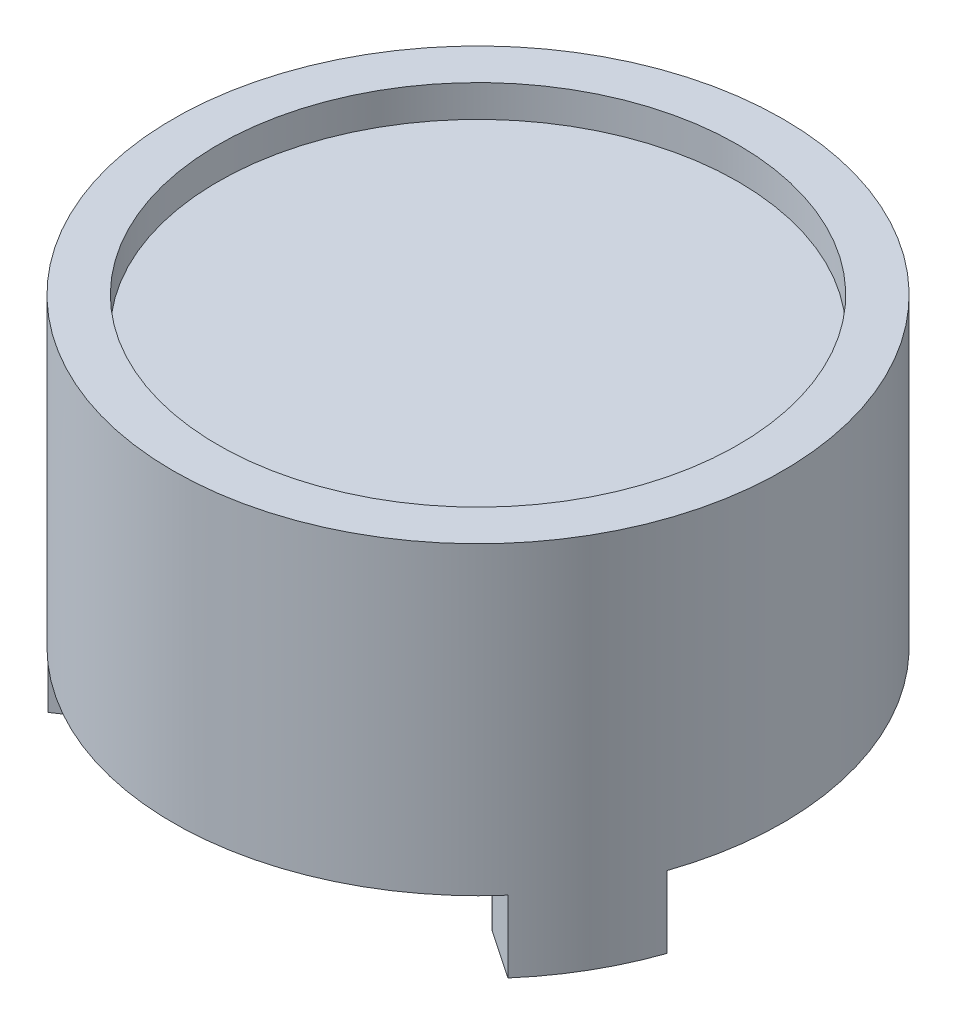
ISO-10303-21;
HEADER;
FILE_DESCRIPTION(('STEP AP214'),'2;1');
FILE_NAME('part.step','',(''),(''),'','','');
FILE_SCHEMA(('AUTOMOTIVE_DESIGN { 1 0 10303 214 1 1 1 1 }'));
ENDSEC;
DATA;
#1=APPLICATION_CONTEXT('core data for automotive mechanical design processes');
#2=APPLICATION_PROTOCOL_DEFINITION('international standard','automotive_design',2000,#1);
#3=PRODUCT_CONTEXT('',#1,'mechanical');
#4=PRODUCT('Part','Part','',(#3));
#5=PRODUCT_RELATED_PRODUCT_CATEGORY('part','',(#4));
#6=PRODUCT_DEFINITION_FORMATION('','',#4);
#7=PRODUCT_DEFINITION_CONTEXT('part definition',#1,'design');
#8=PRODUCT_DEFINITION('design','',#6,#7);
#9=PRODUCT_DEFINITION_SHAPE('','',#8);
#10=(LENGTH_UNIT() NAMED_UNIT(*) SI_UNIT(.MILLI.,.METRE.));
#11=(NAMED_UNIT(*) PLANE_ANGLE_UNIT() SI_UNIT($,.RADIAN.));
#12=(NAMED_UNIT(*) SI_UNIT($,.STERADIAN.) SOLID_ANGLE_UNIT());
#13=UNCERTAINTY_MEASURE_WITH_UNIT(LENGTH_MEASURE(1.E-05),#10,'distance_accuracy_value','');
#14=(GEOMETRIC_REPRESENTATION_CONTEXT(3) GLOBAL_UNCERTAINTY_ASSIGNED_CONTEXT((#13)) GLOBAL_UNIT_ASSIGNED_CONTEXT((#10,
#11,#12)) REPRESENTATION_CONTEXT('',''));
#15=CARTESIAN_POINT('',(0.,0.,0.));
#16=DIRECTION('',(0.,0.,1.));
#17=DIRECTION('',(1.,0.,0.));
#18=AXIS2_PLACEMENT_3D('',#15,#16,#17);
#19=CARTESIAN_POINT('',(13.5,0.,0.));
#20=DIRECTION('',(0.,-1.,0.));
#21=DIRECTION('',(0.,0.,-1.));
#22=AXIS2_PLACEMENT_3D('',#19,#20,#21);
#23=PLANE('',#22);
#24=CARTESIAN_POINT('',(0.,0.,0.));
#25=DIRECTION('',(0.,-1.,0.));
#26=DIRECTION('',(0.,0.,-1.));
#27=AXIS2_PLACEMENT_3D('',#24,#25,#26);
#28=CIRCLE('',#27,17.);
#29=CARTESIAN_POINT('',(-16.0758866509983,0.,5.52864073568305));
#30=VERTEX_POINT('',#29);
#31=CARTESIAN_POINT('',(-3.25,0.,-16.6864465959653));
#32=VERTEX_POINT('',#31);
#33=EDGE_CURVE('E295',#30,#32,#28,.T.);
#34=ORIENTED_EDGE('',*,*,#33,.T.);
#35=DIRECTION('',(0.0707642638276949,0.,0.997493067126246));
#36=VECTOR('',#35,1.);
#37=CARTESIAN_POINT('',(-3.25,0.,-16.6864465959653));
#38=LINE('',#37,#36);
#39=CARTESIAN_POINT('',(-3.02073627194072,0.,-13.4547450715984));
#40=VERTEX_POINT('',#39);
#41=EDGE_CURVE('E167',#32,#40,#38,.T.);
#42=ORIENTED_EDGE('',*,*,#41,.T.);
#43=CARTESIAN_POINT('',(-2.76737303289065,0.,-13.4727191946106));
#44=DIRECTION('',(0.,-1.,0.));
#45=DIRECTION('',(0.,0.,-1.));
#46=AXIS2_PLACEMENT_3D('',#43,#44,#45);
#47=CIRCLE('',#46,0.254);
#48=CARTESIAN_POINT('',(-2.71626697280963,0.,-13.2239137070847));
#49=VERTEX_POINT('',#48);
#50=EDGE_CURVE('E244',#40,#49,#47,.F.);
#51=ORIENTED_EDGE('',*,*,#50,.T.);
#52=CARTESIAN_POINT('',(0.,0.,0.));
#53=DIRECTION('',(0.,-1.,0.));
#54=DIRECTION('',(0.,0.,-1.));
#55=AXIS2_PLACEMENT_3D('',#52,#53,#54);
#56=CIRCLE('',#55,13.5);
#57=CARTESIAN_POINT('',(-12.8103786941935,0.,4.25960065162846));
#58=VERTEX_POINT('',#57);
#59=EDGE_CURVE('E297',#58,#49,#56,.T.);
#60=ORIENTED_EDGE('',*,*,#59,.F.);
#61=CARTESIAN_POINT('',(-13.0514035970324,0.,4.33974424907391));
#62=DIRECTION('',(0.,-1.,0.));
#63=DIRECTION('',(0.,0.,-1.));
#64=AXIS2_PLACEMENT_3D('',#61,#62,#63);
#65=CIRCLE('',#64,0.254);
#66=CARTESIAN_POINT('',(-13.1625191694181,0.,4.11133818616531));
#67=VERTEX_POINT('',#66);
#68=EDGE_CURVE('E239',#58,#67,#65,.F.);
#69=ORIENTED_EDGE('',*,*,#68,.T.);
#70=DIRECTION('',(-0.899236468144037,0.,0.437462883408227));
#71=VECTOR('',#70,1.);
#72=CARTESIAN_POINT('',(-16.0758866509983,0.,5.52864073568305));
#73=LINE('',#72,#71);
#74=EDGE_CURVE('E281',#67,#30,#73,.T.);
#75=ORIENTED_EDGE('',*,*,#74,.T.);
#76=EDGE_LOOP('',(#34,#42,#51,#60,#69,#75));
#77=FACE_BOUND('',#76,.T.);
#78=ADVANCED_FACE('F36',(#77),#23,.T.);
#79=CARTESIAN_POINT('',(-16.0758866509983,-4.,5.52864073568305));
#80=DIRECTION('',(-0.437462883408227,0.,-0.899236468144037));
#81=DIRECTION('',(-0.899236468144037,0.,0.437462883408227));
#82=AXIS2_PLACEMENT_3D('',#79,#80,#81);
#83=PLANE('',#82);
#84=ORIENTED_EDGE('',*,*,#74,.F.);
#85=DIRECTION('',(0.,-1.,0.));
#86=VECTOR('',#85,1.);
#87=CARTESIAN_POINT('',(-13.1625191694181,-4.,4.11133818616531));
#88=LINE('',#87,#86);
#89=CARTESIAN_POINT('',(-13.1625191694181,-4.,4.11133818616531));
#90=VERTEX_POINT('',#89);
#91=EDGE_CURVE('E280',#67,#90,#88,.T.);
#92=ORIENTED_EDGE('',*,*,#91,.T.);
#93=DIRECTION('',(-0.899236468144037,0.,0.437462883408227));
#94=VECTOR('',#93,1.);
#95=CARTESIAN_POINT('',(-16.0758866509983,-4.,5.52864073568305));
#96=LINE('',#95,#94);
#97=CARTESIAN_POINT('',(-16.0758866509983,-4.,5.52864073568305));
#98=VERTEX_POINT('',#97);
#99=EDGE_CURVE('E399',#90,#98,#96,.T.);
#100=ORIENTED_EDGE('',*,*,#99,.T.);
#101=DIRECTION('',(0.,1.,0.));
#102=VECTOR('',#101,1.);
#103=CARTESIAN_POINT('',(-16.0758866509983,-4.,5.52864073568305));
#104=LINE('',#103,#102);
#105=EDGE_CURVE('E270',#98,#30,#104,.T.);
#106=ORIENTED_EDGE('',*,*,#105,.T.);
#107=EDGE_LOOP('',(#84,#92,#100,#106));
#108=FACE_BOUND('',#107,.T.);
#109=ADVANCED_FACE('F355',(#108),#83,.T.);
#110=CARTESIAN_POINT('',(-12.8258866509984,-4.,11.1578058602819));
#111=DIRECTION('',(0.560030183718003,0.,0.828472204316343));
#112=DIRECTION('',(0.828472204316343,0.,-0.560030183718003));
#113=AXIS2_PLACEMENT_3D('',#110,#111,#112);
#114=PLANE('',#113);
#115=DIRECTION('',(0.828472204316343,0.,-0.560030183718003));
#116=VECTOR('',#115,1.);
#117=CARTESIAN_POINT('',(-12.8258866509984,-4.,11.1578058602819));
#118=LINE('',#117,#116);
#119=CARTESIAN_POINT('',(-12.8258866509984,-4.,11.1578058602819));
#120=VERTEX_POINT('',#119);
#121=CARTESIAN_POINT('',(-10.1417828974774,-4.,9.34340688543284));
#122=VERTEX_POINT('',#121);
#123=EDGE_CURVE('E388',#120,#122,#118,.T.);
#124=ORIENTED_EDGE('',*,*,#123,.T.);
#125=DIRECTION('',(0.,-1.,0.));
#126=VECTOR('',#125,1.);
#127=CARTESIAN_POINT('',(-10.1417828974774,-4.,9.34340688543284));
#128=LINE('',#127,#126);
#129=CARTESIAN_POINT('',(-10.1417828974774,0.,9.34340688543284));
#130=VERTEX_POINT('',#129);
#131=EDGE_CURVE('E387',#122,#130,#128,.F.);
#132=ORIENTED_EDGE('',*,*,#131,.T.);
#133=DIRECTION('',(0.828472204316343,0.,-0.560030183718003));
#134=VECTOR('',#133,1.);
#135=CARTESIAN_POINT('',(-12.8258866509984,0.,11.1578058602819));
#136=LINE('',#135,#134);
#137=CARTESIAN_POINT('',(-12.8258866509984,0.,11.1578058602819));
#138=VERTEX_POINT('',#137);
#139=EDGE_CURVE('E378',#138,#130,#136,.T.);
#140=ORIENTED_EDGE('',*,*,#139,.F.);
#141=DIRECTION('',(0.,1.,0.));
#142=VECTOR('',#141,1.);
#143=CARTESIAN_POINT('',(-12.8258866509984,-4.,11.1578058602819));
#144=LINE('',#143,#142);
#145=EDGE_CURVE('E284',#120,#138,#144,.T.);
#146=ORIENTED_EDGE('',*,*,#145,.F.);
#147=EDGE_LOOP('',(#124,#132,#140,#146));
#148=FACE_BOUND('',#147,.T.);
#149=ADVANCED_FACE('F360',(#148),#114,.T.);
#150=CARTESIAN_POINT('',(0.,-4.,0.));
#151=DIRECTION('',(0.,-1.,0.));
#152=DIRECTION('',(-0.866025403784444,0.,0.499999999999992));
#153=AXIS2_PLACEMENT_3D('',#150,#151,#152);
#154=PLANE('',#153);
#155=ORIENTED_EDGE('',*,*,#99,.F.);
#156=CARTESIAN_POINT('',(-13.0514035970324,-4.,4.33974424907391));
#157=DIRECTION('',(0.,-1.,0.));
#158=DIRECTION('',(0.,0.,-1.));
#159=AXIS2_PLACEMENT_3D('',#156,#157,#158);
#160=CIRCLE('',#159,0.254);
#161=CARTESIAN_POINT('',(-12.8103786941935,-4.,4.25960065162846));
#162=VERTEX_POINT('',#161);
#163=EDGE_CURVE('E432',#90,#162,#160,.T.);
#164=ORIENTED_EDGE('',*,*,#163,.T.);
#165=CARTESIAN_POINT('',(0.,-4.,0.));
#166=DIRECTION('',(0.,-1.,0.));
#167=DIRECTION('',(0.866025403784444,0.,-0.499999999999992));
#168=AXIS2_PLACEMENT_3D('',#165,#166,#167);
#169=CIRCLE('',#168,13.5);
#170=CARTESIAN_POINT('',(-10.0941117213839,-4.,8.96431305545607));
#171=VERTEX_POINT('',#170);
#172=EDGE_CURVE('E397',#171,#162,#169,.T.);
#173=ORIENTED_EDGE('',*,*,#172,.F.);
#174=CARTESIAN_POINT('',(-10.2840305641418,-4.,9.13297494553649));
#175=DIRECTION('',(0.,-1.,0.));
#176=DIRECTION('',(0.,0.,-1.));
#177=AXIS2_PLACEMENT_3D('',#174,#175,#176);
#178=CIRCLE('',#177,0.254);
#179=EDGE_CURVE('E431',#171,#122,#178,.T.);
#180=ORIENTED_EDGE('',*,*,#179,.T.);
#181=ORIENTED_EDGE('',*,*,#123,.F.);
#182=CARTESIAN_POINT('',(0.,-4.,0.));
#183=DIRECTION('',(0.,1.,0.));
#184=DIRECTION('',(-0.866025403784444,0.,0.499999999999992));
#185=AXIS2_PLACEMENT_3D('',#182,#183,#184);
#186=CIRCLE('',#185,17.);
#187=EDGE_CURVE('E312',#98,#120,#186,.T.);
#188=ORIENTED_EDGE('',*,*,#187,.F.);
#189=EDGE_LOOP('',(#155,#164,#173,#180,#181,#188));
#190=FACE_BOUND('',#189,.T.);
#191=ADVANCED_FACE('F367',(#190),#154,.T.);
#192=CARTESIAN_POINT('',(12.8258866509982,0.,11.1578058602821));
#193=VERTEX_POINT('',#192);
#194=EDGE_CURVE('E307',#193,#138,#28,.T.);
#195=ORIENTED_EDGE('',*,*,#194,.T.);
#196=ORIENTED_EDGE('',*,*,#139,.T.);
#197=CARTESIAN_POINT('',(-10.2840305641418,0.,9.13297494553649));
#198=DIRECTION('',(0.,-1.,0.));
#199=DIRECTION('',(0.,0.,-1.));
#200=AXIS2_PLACEMENT_3D('',#197,#198,#199);
#201=CIRCLE('',#200,0.254);
#202=CARTESIAN_POINT('',(-10.0941117213839,0.,8.96431305545607));
#203=VERTEX_POINT('',#202);
#204=EDGE_CURVE('E241',#130,#203,#201,.F.);
#205=ORIENTED_EDGE('',*,*,#204,.T.);
#206=CARTESIAN_POINT('',(10.0941117213838,0.,8.96431305545623));
#207=VERTEX_POINT('',#206);
#208=EDGE_CURVE('E210',#207,#203,#56,.T.);
#209=ORIENTED_EDGE('',*,*,#208,.F.);
#210=CARTESIAN_POINT('',(10.2840305641417,0.,9.13297494553665));
#211=DIRECTION('',(0.,-1.,0.));
#212=DIRECTION('',(0.,0.,-1.));
#213=AXIS2_PLACEMENT_3D('',#210,#211,#212);
#214=CIRCLE('',#213,0.254);
#215=CARTESIAN_POINT('',(10.1417828974773,0.,9.343406885433));
#216=VERTEX_POINT('',#215);
#217=EDGE_CURVE('E11',#207,#216,#214,.F.);
#218=ORIENTED_EDGE('',*,*,#217,.T.);
#219=DIRECTION('',(0.828472204316335,0.,0.560030183718015));
#220=VECTOR('',#219,1.);
#221=CARTESIAN_POINT('',(12.8258866509982,0.,11.1578058602821));
#222=LINE('',#221,#220);
#223=EDGE_CURVE('E226',#216,#193,#222,.T.);
#224=ORIENTED_EDGE('',*,*,#223,.T.);
#225=EDGE_LOOP('',(#195,#196,#205,#209,#218,#224));
#226=FACE_BOUND('',#225,.T.);
#227=ADVANCED_FACE('F352',(#226),#23,.T.);
#228=CARTESIAN_POINT('',(12.8258866509982,-4.,11.1578058602821));
#229=DIRECTION('',(-0.560030183718015,0.,0.828472204316335));
#230=DIRECTION('',(0.828472204316336,0.,0.560030183718015));
#231=AXIS2_PLACEMENT_3D('',#228,#229,#230);
#232=PLANE('',#231);
#233=ORIENTED_EDGE('',*,*,#223,.F.);
#234=DIRECTION('',(0.,-1.,0.));
#235=VECTOR('',#234,1.);
#236=CARTESIAN_POINT('',(10.1417828974773,-4.,9.343406885433));
#237=LINE('',#236,#235);
#238=CARTESIAN_POINT('',(10.1417828974773,-4.,9.343406885433));
#239=VERTEX_POINT('',#238);
#240=EDGE_CURVE('E56',#216,#239,#237,.T.);
#241=ORIENTED_EDGE('',*,*,#240,.T.);
#242=DIRECTION('',(0.828472204316335,0.,0.560030183718015));
#243=VECTOR('',#242,1.);
#244=CARTESIAN_POINT('',(12.8258866509982,-4.,11.1578058602821));
#245=LINE('',#244,#243);
#246=CARTESIAN_POINT('',(12.8258866509982,-4.,11.1578058602821));
#247=VERTEX_POINT('',#246);
#248=EDGE_CURVE('E209',#239,#247,#245,.T.);
#249=ORIENTED_EDGE('',*,*,#248,.T.);
#250=DIRECTION('',(0.,1.,0.));
#251=VECTOR('',#250,1.);
#252=CARTESIAN_POINT('',(12.8258866509982,-4.,11.1578058602821));
#253=LINE('',#252,#251);
#254=EDGE_CURVE('E231',#247,#193,#253,.T.);
#255=ORIENTED_EDGE('',*,*,#254,.T.);
#256=EDGE_LOOP('',(#233,#241,#249,#255));
#257=FACE_BOUND('',#256,.T.);
#258=ADVANCED_FACE('F366',(#257),#232,.T.);
#259=CARTESIAN_POINT('',(16.0758866509983,-4.,5.52864073568327));
#260=DIRECTION('',(0.437462883408239,0.,-0.899236468144031));
#261=DIRECTION('',(-0.899236468144031,0.,-0.437462883408239));
#262=AXIS2_PLACEMENT_3D('',#259,#260,#261);
#263=PLANE('',#262);
#264=DIRECTION('',(-0.899236468144031,0.,-0.437462883408239));
#265=VECTOR('',#264,1.);
#266=CARTESIAN_POINT('',(16.0758866509983,-4.,5.52864073568327));
#267=LINE('',#266,#265);
#268=CARTESIAN_POINT('',(16.0758866509983,-4.,5.52864073568327));
#269=VERTEX_POINT('',#268);
#270=CARTESIAN_POINT('',(13.162519169418,-4.,4.11133818616549));
#271=VERTEX_POINT('',#270);
#272=EDGE_CURVE('E215',#269,#271,#267,.T.);
#273=ORIENTED_EDGE('',*,*,#272,.T.);
#274=DIRECTION('',(0.,-1.,0.));
#275=VECTOR('',#274,1.);
#276=CARTESIAN_POINT('',(13.162519169418,-4.,4.11133818616549));
#277=LINE('',#276,#275);
#278=CARTESIAN_POINT('',(13.162519169418,0.,4.11133818616549));
#279=VERTEX_POINT('',#278);
#280=EDGE_CURVE('E412',#271,#279,#277,.F.);
#281=ORIENTED_EDGE('',*,*,#280,.T.);
#282=DIRECTION('',(-0.899236468144031,0.,-0.437462883408239));
#283=VECTOR('',#282,1.);
#284=CARTESIAN_POINT('',(16.0758866509983,0.,5.52864073568327));
#285=LINE('',#284,#283);
#286=CARTESIAN_POINT('',(16.0758866509983,0.,5.52864073568327));
#287=VERTEX_POINT('',#286);
#288=EDGE_CURVE('E218',#287,#279,#285,.T.);
#289=ORIENTED_EDGE('',*,*,#288,.F.);
#290=DIRECTION('',(0.,1.,0.));
#291=VECTOR('',#290,1.);
#292=CARTESIAN_POINT('',(16.0758866509983,-4.,5.52864073568327));
#293=LINE('',#292,#291);
#294=EDGE_CURVE('E221',#269,#287,#293,.T.);
#295=ORIENTED_EDGE('',*,*,#294,.F.);
#296=EDGE_LOOP('',(#273,#281,#289,#295));
#297=FACE_BOUND('',#296,.T.);
#298=ADVANCED_FACE('F372',(#297),#263,.T.);
#299=CARTESIAN_POINT('',(0.,-4.,0.));
#300=DIRECTION('',(0.,-1.,0.));
#301=DIRECTION('',(0.866025403784437,0.,0.500000000000004));
#302=AXIS2_PLACEMENT_3D('',#299,#300,#301);
#303=PLANE('',#302);
#304=CARTESIAN_POINT('',(0.,-4.,0.));
#305=DIRECTION('',(0.,-1.,0.));
#306=DIRECTION('',(-0.866025403784437,0.,-0.500000000000004));
#307=AXIS2_PLACEMENT_3D('',#304,#305,#306);
#308=CIRCLE('',#307,13.5);
#309=CARTESIAN_POINT('',(12.8103786941934,-4.,4.25960065162863));
#310=VERTEX_POINT('',#309);
#311=CARTESIAN_POINT('',(10.0941117213838,-4.,8.96431305545623));
#312=VERTEX_POINT('',#311);
#313=EDGE_CURVE('E212',#310,#312,#308,.T.);
#314=ORIENTED_EDGE('',*,*,#313,.F.);
#315=CARTESIAN_POINT('',(13.0514035970323,-4.,4.33974424907409));
#316=DIRECTION('',(0.,-1.,0.));
#317=DIRECTION('',(0.,0.,-1.));
#318=AXIS2_PLACEMENT_3D('',#315,#316,#317);
#319=CIRCLE('',#318,0.254);
#320=EDGE_CURVE('E236',#310,#271,#319,.T.);
#321=ORIENTED_EDGE('',*,*,#320,.T.);
#322=ORIENTED_EDGE('',*,*,#272,.F.);
#323=CARTESIAN_POINT('',(0.,-4.,0.));
#324=DIRECTION('',(0.,1.,0.));
#325=DIRECTION('',(0.866025403784437,0.,0.500000000000004));
#326=AXIS2_PLACEMENT_3D('',#323,#324,#325);
#327=CIRCLE('',#326,17.);
#328=EDGE_CURVE('E207',#247,#269,#327,.T.);
#329=ORIENTED_EDGE('',*,*,#328,.F.);
#330=ORIENTED_EDGE('',*,*,#248,.F.);
#331=CARTESIAN_POINT('',(10.2840305641417,-4.,9.13297494553665));
#332=DIRECTION('',(0.,-1.,0.));
#333=DIRECTION('',(0.,0.,-1.));
#334=AXIS2_PLACEMENT_3D('',#331,#332,#333);
#335=CIRCLE('',#334,0.254);
#336=EDGE_CURVE('E417',#239,#312,#335,.T.);
#337=ORIENTED_EDGE('',*,*,#336,.T.);
#338=EDGE_LOOP('',(#314,#321,#322,#329,#330,#337));
#339=FACE_BOUND('',#338,.T.);
#340=ADVANCED_FACE('F350',(#339),#303,.T.);
#341=CARTESIAN_POINT('',(3.25,0.,-16.6864465959653));
#342=VERTEX_POINT('',#341);
#343=EDGE_CURVE('E302',#342,#287,#28,.T.);
#344=ORIENTED_EDGE('',*,*,#343,.T.);
#345=ORIENTED_EDGE('',*,*,#288,.T.);
#346=CARTESIAN_POINT('',(13.0514035970323,0.,4.33974424907409));
#347=DIRECTION('',(0.,-1.,0.));
#348=DIRECTION('',(0.,0.,-1.));
#349=AXIS2_PLACEMENT_3D('',#346,#347,#348);
#350=CIRCLE('',#349,0.254);
#351=CARTESIAN_POINT('',(12.8103786941934,0.,4.25960065162863));
#352=VERTEX_POINT('',#351);
#353=EDGE_CURVE('E44',#279,#352,#350,.F.);
#354=ORIENTED_EDGE('',*,*,#353,.T.);
#355=CARTESIAN_POINT('',(2.71626697280963,0.,-13.2239137070847));
#356=VERTEX_POINT('',#355);
#357=EDGE_CURVE('E252',#356,#352,#56,.T.);
#358=ORIENTED_EDGE('',*,*,#357,.F.);
#359=CARTESIAN_POINT('',(2.76737303289065,0.,-13.4727191946106));
#360=DIRECTION('',(0.,-1.,0.));
#361=DIRECTION('',(0.,0.,-1.));
#362=AXIS2_PLACEMENT_3D('',#359,#360,#361);
#363=CIRCLE('',#362,0.254);
#364=CARTESIAN_POINT('',(3.02073627194072,0.,-13.4547450715984));
#365=VERTEX_POINT('',#364);
#366=EDGE_CURVE('E247',#356,#365,#363,.F.);
#367=ORIENTED_EDGE('',*,*,#366,.T.);
#368=DIRECTION('',(0.070764263827695,0.,-0.997493067126246));
#369=VECTOR('',#368,1.);
#370=CARTESIAN_POINT('',(3.25,0.,-16.6864465959653));
#371=LINE('',#370,#369);
#372=EDGE_CURVE('E189',#365,#342,#371,.T.);
#373=ORIENTED_EDGE('',*,*,#372,.T.);
#374=EDGE_LOOP('',(#344,#345,#354,#358,#367,#373));
#375=FACE_BOUND('',#374,.T.);
#376=ADVANCED_FACE('F251',(#375),#23,.T.);
#377=CARTESIAN_POINT('',(0.,15.222,0.));
#378=DIRECTION('',(0.,1.,0.));
#379=DIRECTION('',(0.,0.,1.));
#380=AXIS2_PLACEMENT_3D('',#377,#378,#379);
#381=PLANE('',#380);
#382=CARTESIAN_POINT('',(0.,15.222,0.));
#383=DIRECTION('',(0.,-1.,0.));
#384=DIRECTION('',(0.,0.,-1.));
#385=AXIS2_PLACEMENT_3D('',#382,#383,#384);
#386=CIRCLE('',#385,14.5);
#387=CARTESIAN_POINT('',(0.,15.222,-14.5));
#388=VERTEX_POINT('',#387);
#389=EDGE_CURVE('E309',#388,#388,#386,.T.);
#390=ORIENTED_EDGE('',*,*,#389,.F.);
#391=EDGE_LOOP('',(#390));
#392=FACE_BOUND('',#391,.T.);
#393=ADVANCED_FACE('F341',(#392),#381,.T.);
#394=CARTESIAN_POINT('',(0.,0.,0.));
#395=DIRECTION('',(0.,-1.,0.));
#396=DIRECTION('',(0.,0.,-1.));
#397=AXIS2_PLACEMENT_3D('',#394,#395,#396);
#398=CYLINDRICAL_SURFACE('',#397,14.5);
#399=ORIENTED_EDGE('',*,*,#389,.T.);
#400=EDGE_LOOP('',(#399));
#401=FACE_BOUND('',#400,.T.);
#402=CARTESIAN_POINT('',(0.,17.,0.));
#403=DIRECTION('',(0.,-1.,0.));
#404=DIRECTION('',(0.,0.,-1.));
#405=AXIS2_PLACEMENT_3D('',#402,#403,#404);
#406=CIRCLE('',#405,14.5);
#407=CARTESIAN_POINT('',(0.,17.,-14.5));
#408=VERTEX_POINT('',#407);
#409=EDGE_CURVE('E333',#408,#408,#406,.T.);
#410=ORIENTED_EDGE('',*,*,#409,.F.);
#411=EDGE_LOOP('',(#410));
#412=FACE_BOUND('',#411,.T.);
#413=ADVANCED_FACE('F338',(#401,#412),#398,.F.);
#414=CARTESIAN_POINT('',(17.,17.,0.));
#415=DIRECTION('',(0.,1.,0.));
#416=DIRECTION('',(0.,0.,1.));
#417=AXIS2_PLACEMENT_3D('',#414,#415,#416);
#418=PLANE('',#417);
#419=ORIENTED_EDGE('',*,*,#409,.T.);
#420=EDGE_LOOP('',(#419));
#421=FACE_BOUND('',#420,.T.);
#422=CARTESIAN_POINT('',(0.,17.,0.));
#423=DIRECTION('',(0.,-1.,0.));
#424=DIRECTION('',(0.,0.,-1.));
#425=AXIS2_PLACEMENT_3D('',#422,#423,#424);
#426=CIRCLE('',#425,17.);
#427=CARTESIAN_POINT('',(0.,17.,-17.));
#428=VERTEX_POINT('',#427);
#429=EDGE_CURVE('E330',#428,#428,#426,.T.);
#430=ORIENTED_EDGE('',*,*,#429,.F.);
#431=EDGE_LOOP('',(#430));
#432=FACE_BOUND('',#431,.T.);
#433=ADVANCED_FACE('F348',(#421,#432),#418,.T.);
#434=CARTESIAN_POINT('',(0.,0.,0.));
#435=DIRECTION('',(0.,-1.,0.));
#436=DIRECTION('',(0.,0.,-1.));
#437=AXIS2_PLACEMENT_3D('',#434,#435,#436);
#438=CYLINDRICAL_SURFACE('',#437,17.);
#439=ORIENTED_EDGE('',*,*,#429,.T.);
#440=EDGE_LOOP('',(#439));
#441=FACE_BOUND('',#440,.T.);
#442=ORIENTED_EDGE('',*,*,#194,.F.);
#443=ORIENTED_EDGE('',*,*,#254,.F.);
#444=ORIENTED_EDGE('',*,*,#328,.T.);
#445=ORIENTED_EDGE('',*,*,#294,.T.);
#446=ORIENTED_EDGE('',*,*,#343,.F.);
#447=DIRECTION('',(0.,1.,0.));
#448=VECTOR('',#447,1.);
#449=CARTESIAN_POINT('',(3.25,-4.,-16.6864465959653));
#450=LINE('',#449,#448);
#451=CARTESIAN_POINT('',(3.25,-4.,-16.6864465959653));
#452=VERTEX_POINT('',#451);
#453=EDGE_CURVE('E171',#452,#342,#450,.T.);
#454=ORIENTED_EDGE('',*,*,#453,.F.);
#455=CARTESIAN_POINT('',(0.,-4.,0.));
#456=DIRECTION('',(0.,1.,0.));
#457=DIRECTION('',(0.,0.,-1.));
#458=AXIS2_PLACEMENT_3D('',#455,#456,#457);
#459=CIRCLE('',#458,17.);
#460=CARTESIAN_POINT('',(-3.25,-4.,-16.6864465959653));
#461=VERTEX_POINT('',#460);
#462=EDGE_CURVE('E179',#452,#461,#459,.T.);
#463=ORIENTED_EDGE('',*,*,#462,.T.);
#464=DIRECTION('',(0.,1.,0.));
#465=VECTOR('',#464,1.);
#466=CARTESIAN_POINT('',(-3.25,-4.,-16.6864465959653));
#467=LINE('',#466,#465);
#468=EDGE_CURVE('E160',#461,#32,#467,.T.);
#469=ORIENTED_EDGE('',*,*,#468,.T.);
#470=ORIENTED_EDGE('',*,*,#33,.F.);
#471=ORIENTED_EDGE('',*,*,#105,.F.);
#472=ORIENTED_EDGE('',*,*,#187,.T.);
#473=ORIENTED_EDGE('',*,*,#145,.T.);
#474=EDGE_LOOP('',(#442,#443,#444,#445,#446,#454,#463,#469,#470,#471,#472,#473));
#475=FACE_BOUND('',#474,.T.);
#476=ADVANCED_FACE('F186',(#441,#475),#438,.T.);
#477=CARTESIAN_POINT('',(0.,0.,0.));
#478=DIRECTION('',(0.,-1.,0.));
#479=DIRECTION('',(0.,0.,-1.));
#480=AXIS2_PLACEMENT_3D('',#477,#478,#479);
#481=CYLINDRICAL_SURFACE('',#480,13.5);
#482=ORIENTED_EDGE('',*,*,#172,.T.);
#483=DIRECTION('',(0.,-1.,0.));
#484=VECTOR('',#483,1.);
#485=CARTESIAN_POINT('',(-12.8103786941935,0.,4.25960065162846));
#486=LINE('',#485,#484);
#487=EDGE_CURVE('E277',#162,#58,#486,.F.);
#488=ORIENTED_EDGE('',*,*,#487,.T.);
#489=ORIENTED_EDGE('',*,*,#59,.T.);
#490=DIRECTION('',(0.,-1.,0.));
#491=VECTOR('',#490,1.);
#492=CARTESIAN_POINT('',(-2.71626697280963,0.,-13.2239137070847));
#493=LINE('',#492,#491);
#494=CARTESIAN_POINT('',(-2.71626697280963,-4.,-13.2239137070847));
#495=VERTEX_POINT('',#494);
#496=EDGE_CURVE('E267',#49,#495,#493,.T.);
#497=ORIENTED_EDGE('',*,*,#496,.T.);
#498=CARTESIAN_POINT('',(0.,-4.,0.));
#499=DIRECTION('',(0.,-1.,0.));
#500=DIRECTION('',(0.,0.,1.));
#501=AXIS2_PLACEMENT_3D('',#498,#499,#500);
#502=CIRCLE('',#501,13.5);
#503=CARTESIAN_POINT('',(2.71626697280963,-4.,-13.2239137070847));
#504=VERTEX_POINT('',#503);
#505=EDGE_CURVE('E182',#495,#504,#502,.T.);
#506=ORIENTED_EDGE('',*,*,#505,.T.);
#507=DIRECTION('',(0.,-1.,0.));
#508=VECTOR('',#507,1.);
#509=CARTESIAN_POINT('',(2.71626697280963,0.,-13.2239137070847));
#510=LINE('',#509,#508);
#511=EDGE_CURVE('E263',#504,#356,#510,.F.);
#512=ORIENTED_EDGE('',*,*,#511,.T.);
#513=ORIENTED_EDGE('',*,*,#357,.T.);
#514=DIRECTION('',(0.,-1.,0.));
#515=VECTOR('',#514,1.);
#516=CARTESIAN_POINT('',(12.8103786941934,0.,4.25960065162863));
#517=LINE('',#516,#515);
#518=EDGE_CURVE('E259',#352,#310,#517,.T.);
#519=ORIENTED_EDGE('',*,*,#518,.T.);
#520=ORIENTED_EDGE('',*,*,#313,.T.);
#521=DIRECTION('',(0.,-1.,0.));
#522=VECTOR('',#521,1.);
#523=CARTESIAN_POINT('',(10.0941117213838,0.,8.96431305545623));
#524=LINE('',#523,#522);
#525=EDGE_CURVE('E264',#312,#207,#524,.F.);
#526=ORIENTED_EDGE('',*,*,#525,.T.);
#527=ORIENTED_EDGE('',*,*,#208,.T.);
#528=DIRECTION('',(0.,-1.,0.));
#529=VECTOR('',#528,1.);
#530=CARTESIAN_POINT('',(-10.0941117213839,0.,8.96431305545607));
#531=LINE('',#530,#529);
#532=EDGE_CURVE('E275',#203,#171,#531,.T.);
#533=ORIENTED_EDGE('',*,*,#532,.T.);
#534=EDGE_LOOP('',(#482,#488,#489,#497,#506,#512,#513,#519,#520,#526,#527,#533));
#535=FACE_BOUND('',#534,.T.);
#536=CARTESIAN_POINT('',(0.,1.,0.));
#537=DIRECTION('',(0.,-1.,0.));
#538=DIRECTION('',(0.,0.,-1.));
#539=AXIS2_PLACEMENT_3D('',#536,#537,#538);
#540=CIRCLE('',#539,13.5);
#541=CARTESIAN_POINT('',(0.,1.,-13.5));
#542=VERTEX_POINT('',#541);
#543=EDGE_CURVE('E325',#542,#542,#540,.T.);
#544=ORIENTED_EDGE('',*,*,#543,.F.);
#545=EDGE_LOOP('',(#544));
#546=FACE_BOUND('',#545,.T.);
#547=ADVANCED_FACE('F401',(#535,#546),#481,.F.);
#548=CARTESIAN_POINT('',(14.5,1.,0.));
#549=DIRECTION('',(0.,1.,0.));
#550=DIRECTION('',(0.,0.,1.));
#551=AXIS2_PLACEMENT_3D('',#548,#549,#550);
#552=PLANE('',#551);
#553=ORIENTED_EDGE('',*,*,#543,.T.);
#554=EDGE_LOOP('',(#553));
#555=FACE_BOUND('',#554,.T.);
#556=CARTESIAN_POINT('',(0.,1.,0.));
#557=DIRECTION('',(0.,-1.,0.));
#558=DIRECTION('',(0.,0.,-1.));
#559=AXIS2_PLACEMENT_3D('',#556,#557,#558);
#560=CIRCLE('',#559,14.5);
#561=CARTESIAN_POINT('',(0.,1.,-14.5));
#562=VERTEX_POINT('',#561);
#563=EDGE_CURVE('E321',#562,#562,#560,.T.);
#564=ORIENTED_EDGE('',*,*,#563,.F.);
#565=EDGE_LOOP('',(#564));
#566=FACE_BOUND('',#565,.T.);
#567=ADVANCED_FACE('F533',(#555,#566),#552,.T.);
#568=CARTESIAN_POINT('',(0.,0.,0.));
#569=DIRECTION('',(0.,-1.,0.));
#570=DIRECTION('',(0.,0.,-1.));
#571=AXIS2_PLACEMENT_3D('',#568,#569,#570);
#572=CYLINDRICAL_SURFACE('',#571,14.5);
#573=ORIENTED_EDGE('',*,*,#563,.T.);
#574=EDGE_LOOP('',(#573));
#575=FACE_BOUND('',#574,.T.);
#576=CARTESIAN_POINT('',(0.,2.52200000000002,0.));
#577=DIRECTION('',(0.,-1.,0.));
#578=DIRECTION('',(0.,0.,-1.));
#579=AXIS2_PLACEMENT_3D('',#576,#577,#578);
#580=CIRCLE('',#579,14.5);
#581=CARTESIAN_POINT('',(0.,2.52200000000002,-14.5));
#582=VERTEX_POINT('',#581);
#583=EDGE_CURVE('E317',#582,#582,#580,.T.);
#584=ORIENTED_EDGE('',*,*,#583,.F.);
#585=EDGE_LOOP('',(#584));
#586=FACE_BOUND('',#585,.T.);
#587=ADVANCED_FACE('F523',(#575,#586),#572,.F.);
#588=CARTESIAN_POINT('',(14.5,2.52200000000002,0.));
#589=DIRECTION('',(0.,-1.,0.));
#590=DIRECTION('',(0.,0.,-1.));
#591=AXIS2_PLACEMENT_3D('',#588,#589,#590);
#592=PLANE('',#591);
#593=ORIENTED_EDGE('',*,*,#583,.T.);
#594=EDGE_LOOP('',(#593));
#595=FACE_BOUND('',#594,.T.);
#596=ADVANCED_FACE('F513',(#595),#592,.T.);
#597=CARTESIAN_POINT('',(3.25,-4.,-16.6864465959653));
#598=DIRECTION('',(0.997493067126246,0.,0.070764263827695));
#599=DIRECTION('',(0.070764263827695,0.,-0.997493067126246));
#600=AXIS2_PLACEMENT_3D('',#597,#598,#599);
#601=PLANE('',#600);
#602=ORIENTED_EDGE('',*,*,#372,.F.);
#603=DIRECTION('',(0.,-1.,0.));
#604=VECTOR('',#603,1.);
#605=CARTESIAN_POINT('',(3.02073627194072,-4.,-13.4547450715984));
#606=LINE('',#605,#604);
#607=CARTESIAN_POINT('',(3.02073627194072,-4.,-13.4547450715984));
#608=VERTEX_POINT('',#607);
#609=EDGE_CURVE('E409',#365,#608,#606,.T.);
#610=ORIENTED_EDGE('',*,*,#609,.T.);
#611=DIRECTION('',(0.070764263827695,0.,-0.997493067126246));
#612=VECTOR('',#611,1.);
#613=CARTESIAN_POINT('',(3.25,-4.,-16.6864465959653));
#614=LINE('',#613,#612);
#615=EDGE_CURVE('E172',#608,#452,#614,.T.);
#616=ORIENTED_EDGE('',*,*,#615,.T.);
#617=ORIENTED_EDGE('',*,*,#453,.T.);
#618=EDGE_LOOP('',(#602,#610,#616,#617));
#619=FACE_BOUND('',#618,.T.);
#620=ADVANCED_FACE('F504',(#619),#601,.T.);
#621=CARTESIAN_POINT('',(-3.25,-4.,-16.6864465959653));
#622=DIRECTION('',(-0.997493067126246,0.,0.0707642638276949));
#623=DIRECTION('',(0.0707642638276951,0.,0.997493067126246));
#624=AXIS2_PLACEMENT_3D('',#621,#622,#623);
#625=PLANE('',#624);
#626=DIRECTION('',(0.0707642638276949,0.,0.997493067126246));
#627=VECTOR('',#626,1.);
#628=CARTESIAN_POINT('',(-3.25,-4.,-16.6864465959653));
#629=LINE('',#628,#627);
#630=CARTESIAN_POINT('',(-3.02073627194072,-4.,-13.4547450715984));
#631=VERTEX_POINT('',#630);
#632=EDGE_CURVE('E164',#461,#631,#629,.T.);
#633=ORIENTED_EDGE('',*,*,#632,.T.);
#634=DIRECTION('',(0.,-1.,0.));
#635=VECTOR('',#634,1.);
#636=CARTESIAN_POINT('',(-3.02073627194072,-4.,-13.4547450715984));
#637=LINE('',#636,#635);
#638=EDGE_CURVE('E408',#631,#40,#637,.F.);
#639=ORIENTED_EDGE('',*,*,#638,.T.);
#640=ORIENTED_EDGE('',*,*,#41,.F.);
#641=ORIENTED_EDGE('',*,*,#468,.F.);
#642=EDGE_LOOP('',(#633,#639,#640,#641));
#643=FACE_BOUND('',#642,.T.);
#644=ADVANCED_FACE('F162',(#643),#625,.T.);
#645=CARTESIAN_POINT('',(0.,-4.,0.));
#646=DIRECTION('',(0.,-1.,0.));
#647=DIRECTION('',(0.,0.,-1.));
#648=AXIS2_PLACEMENT_3D('',#645,#646,#647);
#649=PLANE('',#648);
#650=ORIENTED_EDGE('',*,*,#505,.F.);
#651=CARTESIAN_POINT('',(-2.76737303289065,-4.,-13.4727191946106));
#652=DIRECTION('',(0.,-1.,0.));
#653=DIRECTION('',(0.,0.,-1.));
#654=AXIS2_PLACEMENT_3D('',#651,#652,#653);
#655=CIRCLE('',#654,0.254);
#656=EDGE_CURVE('E181',#495,#631,#655,.T.);
#657=ORIENTED_EDGE('',*,*,#656,.T.);
#658=ORIENTED_EDGE('',*,*,#632,.F.);
#659=ORIENTED_EDGE('',*,*,#462,.F.);
#660=ORIENTED_EDGE('',*,*,#615,.F.);
#661=CARTESIAN_POINT('',(2.76737303289065,-4.,-13.4727191946106));
#662=DIRECTION('',(0.,-1.,0.));
#663=DIRECTION('',(0.,0.,-1.));
#664=AXIS2_PLACEMENT_3D('',#661,#662,#663);
#665=CIRCLE('',#664,0.254);
#666=EDGE_CURVE('E410',#608,#504,#665,.T.);
#667=ORIENTED_EDGE('',*,*,#666,.T.);
#668=EDGE_LOOP('',(#650,#657,#658,#659,#660,#667));
#669=FACE_BOUND('',#668,.T.);
#670=ADVANCED_FACE('F177',(#669),#649,.T.);
#671=CARTESIAN_POINT('',(-13.0514035970324,0.,4.33974424907391));
#672=DIRECTION('',(0.,-1.,0.));
#673=DIRECTION('',(0.,0.,-1.));
#674=AXIS2_PLACEMENT_3D('',#671,#672,#673);
#675=CYLINDRICAL_SURFACE('',#674,0.254);
#676=ORIENTED_EDGE('',*,*,#163,.F.);
#677=ORIENTED_EDGE('',*,*,#91,.F.);
#678=ORIENTED_EDGE('',*,*,#68,.F.);
#679=ORIENTED_EDGE('',*,*,#487,.F.);
#680=EDGE_LOOP('',(#676,#677,#678,#679));
#681=FACE_BOUND('',#680,.T.);
#682=ADVANCED_FACE('F439',(#681),#675,.T.);
#683=CARTESIAN_POINT('',(-10.2840305641418,0.,9.13297494553649));
#684=DIRECTION('',(0.,-1.,0.));
#685=DIRECTION('',(0.,0.,-1.));
#686=AXIS2_PLACEMENT_3D('',#683,#684,#685);
#687=CYLINDRICAL_SURFACE('',#686,0.254);
#688=ORIENTED_EDGE('',*,*,#179,.F.);
#689=ORIENTED_EDGE('',*,*,#532,.F.);
#690=ORIENTED_EDGE('',*,*,#204,.F.);
#691=ORIENTED_EDGE('',*,*,#131,.F.);
#692=EDGE_LOOP('',(#688,#689,#690,#691));
#693=FACE_BOUND('',#692,.T.);
#694=ADVANCED_FACE('F430',(#693),#687,.T.);
#695=CARTESIAN_POINT('',(-2.76737303289065,0.,-13.4727191946106));
#696=DIRECTION('',(0.,-1.,0.));
#697=DIRECTION('',(0.,0.,-1.));
#698=AXIS2_PLACEMENT_3D('',#695,#696,#697);
#699=CYLINDRICAL_SURFACE('',#698,0.254);
#700=ORIENTED_EDGE('',*,*,#656,.F.);
#701=ORIENTED_EDGE('',*,*,#496,.F.);
#702=ORIENTED_EDGE('',*,*,#50,.F.);
#703=ORIENTED_EDGE('',*,*,#638,.F.);
#704=EDGE_LOOP('',(#700,#701,#702,#703));
#705=FACE_BOUND('',#704,.T.);
#706=ADVANCED_FACE('F407',(#705),#699,.T.);
#707=CARTESIAN_POINT('',(2.76737303289065,0.,-13.4727191946106));
#708=DIRECTION('',(0.,-1.,0.));
#709=DIRECTION('',(0.,0.,-1.));
#710=AXIS2_PLACEMENT_3D('',#707,#708,#709);
#711=CYLINDRICAL_SURFACE('',#710,0.254);
#712=ORIENTED_EDGE('',*,*,#666,.F.);
#713=ORIENTED_EDGE('',*,*,#609,.F.);
#714=ORIENTED_EDGE('',*,*,#366,.F.);
#715=ORIENTED_EDGE('',*,*,#511,.F.);
#716=EDGE_LOOP('',(#712,#713,#714,#715));
#717=FACE_BOUND('',#716,.T.);
#718=ADVANCED_FACE('F452',(#717),#711,.T.);
#719=CARTESIAN_POINT('',(13.0514035970323,0.,4.33974424907409));
#720=DIRECTION('',(0.,-1.,0.));
#721=DIRECTION('',(0.,0.,-1.));
#722=AXIS2_PLACEMENT_3D('',#719,#720,#721);
#723=CYLINDRICAL_SURFACE('',#722,0.254);
#724=ORIENTED_EDGE('',*,*,#320,.F.);
#725=ORIENTED_EDGE('',*,*,#518,.F.);
#726=ORIENTED_EDGE('',*,*,#353,.F.);
#727=ORIENTED_EDGE('',*,*,#280,.F.);
#728=EDGE_LOOP('',(#724,#725,#726,#727));
#729=FACE_BOUND('',#728,.T.);
#730=ADVANCED_FACE('F260',(#729),#723,.T.);
#731=CARTESIAN_POINT('',(10.2840305641417,0.,9.13297494553665));
#732=DIRECTION('',(0.,-1.,0.));
#733=DIRECTION('',(0.,0.,-1.));
#734=AXIS2_PLACEMENT_3D('',#731,#732,#733);
#735=CYLINDRICAL_SURFACE('',#734,0.254);
#736=ORIENTED_EDGE('',*,*,#336,.F.);
#737=ORIENTED_EDGE('',*,*,#240,.F.);
#738=ORIENTED_EDGE('',*,*,#217,.F.);
#739=ORIENTED_EDGE('',*,*,#525,.F.);
#740=EDGE_LOOP('',(#736,#737,#738,#739));
#741=FACE_BOUND('',#740,.T.);
#742=ADVANCED_FACE('F38',(#741),#735,.T.);
#743=CLOSED_SHELL('',(#78,#109,#149,#191,#227,#258,#298,#340,#376,#393,#413,#433,#476,#547,#567,
#587,#596,#620,#644,#670,#682,#694,#706,#718,#730,#742));
#744=MANIFOLD_SOLID_BREP('B2',#743);
#745=ADVANCED_BREP_SHAPE_REPRESENTATION('',(#18,#744),#14);
#746=SHAPE_DEFINITION_REPRESENTATION(#9,#745);
ENDSEC;
END-ISO-10303-21;
